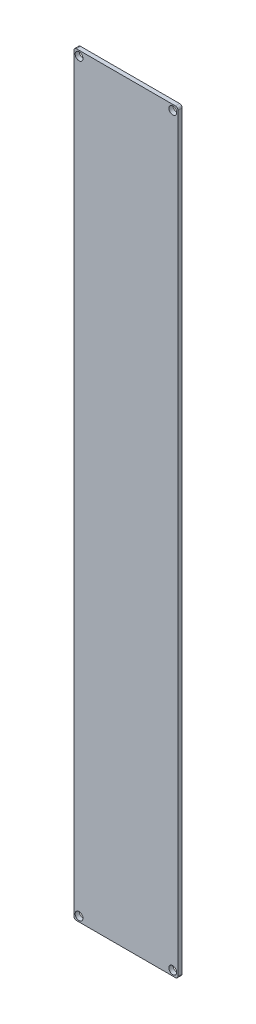
ISO-10303-21;
HEADER;
FILE_DESCRIPTION(('STEP AP214'),'2;1');
FILE_NAME('part.step','',(''),(''),'','','');
FILE_SCHEMA(('AUTOMOTIVE_DESIGN { 1 0 10303 214 1 1 1 1 }'));
ENDSEC;
DATA;
#1=APPLICATION_CONTEXT('core data for automotive mechanical design processes');
#2=APPLICATION_PROTOCOL_DEFINITION('international standard','automotive_design',2000,#1);
#3=PRODUCT_CONTEXT('',#1,'mechanical');
#4=PRODUCT('Part','Part','',(#3));
#5=PRODUCT_RELATED_PRODUCT_CATEGORY('part','',(#4));
#6=PRODUCT_DEFINITION_FORMATION('','',#4);
#7=PRODUCT_DEFINITION_CONTEXT('part definition',#1,'design');
#8=PRODUCT_DEFINITION('design','',#6,#7);
#9=PRODUCT_DEFINITION_SHAPE('','',#8);
#10=(LENGTH_UNIT() NAMED_UNIT(*) SI_UNIT(.MILLI.,.METRE.));
#11=(NAMED_UNIT(*) PLANE_ANGLE_UNIT() SI_UNIT($,.RADIAN.));
#12=(NAMED_UNIT(*) SI_UNIT($,.STERADIAN.) SOLID_ANGLE_UNIT());
#13=UNCERTAINTY_MEASURE_WITH_UNIT(LENGTH_MEASURE(1.E-05),#10,'distance_accuracy_value','');
#14=(GEOMETRIC_REPRESENTATION_CONTEXT(3) GLOBAL_UNCERTAINTY_ASSIGNED_CONTEXT((#13)) GLOBAL_UNIT_ASSIGNED_CONTEXT((#10,
#11,#12)) REPRESENTATION_CONTEXT('',''));
#15=CARTESIAN_POINT('',(0.,0.,0.));
#16=DIRECTION('',(0.,0.,1.));
#17=DIRECTION('',(1.,0.,0.));
#18=AXIS2_PLACEMENT_3D('',#15,#16,#17);
#19=CARTESIAN_POINT('',(-35.5384615384615,79.3692307692308,1.6));
#20=DIRECTION('',(1.,0.,0.));
#21=DIRECTION('',(0.,1.,0.));
#22=AXIS2_PLACEMENT_3D('',#19,#20,#21);
#23=PLANE('',#22);
#24=DIRECTION('',(0.,-1.,0.));
#25=VECTOR('',#24,1.);
#26=CARTESIAN_POINT('',(-35.5384615384615,79.3692307692308,1.6));
#27=LINE('',#26,#25);
#28=CARTESIAN_POINT('',(-35.5384615384615,78.3692307692308,1.6));
#29=VERTEX_POINT('',#28);
#30=CARTESIAN_POINT('',(-35.5384615384615,-209.630769230769,1.6));
#31=VERTEX_POINT('',#30);
#32=EDGE_CURVE('E119',#29,#31,#27,.T.);
#33=ORIENTED_EDGE('',*,*,#32,.F.);
#34=DIRECTION('',(0.,0.,-1.));
#35=VECTOR('',#34,1.);
#36=CARTESIAN_POINT('',(-35.5384615384615,78.3692307692308,1.6));
#37=LINE('',#36,#35);
#38=CARTESIAN_POINT('',(-35.5384615384615,78.3692307692308,0.));
#39=VERTEX_POINT('',#38);
#40=EDGE_CURVE('E104',#29,#39,#37,.T.);
#41=ORIENTED_EDGE('',*,*,#40,.T.);
#42=DIRECTION('',(0.,-1.,0.));
#43=VECTOR('',#42,1.);
#44=CARTESIAN_POINT('',(-35.5384615384615,79.3692307692308,0.));
#45=LINE('',#44,#43);
#46=CARTESIAN_POINT('',(-35.5384615384615,-209.630769230769,0.));
#47=VERTEX_POINT('',#46);
#48=EDGE_CURVE('E116',#39,#47,#45,.T.);
#49=ORIENTED_EDGE('',*,*,#48,.T.);
#50=DIRECTION('',(0.,0.,-1.));
#51=VECTOR('',#50,1.);
#52=CARTESIAN_POINT('',(-35.5384615384615,-209.630769230769,1.6));
#53=LINE('',#52,#51);
#54=EDGE_CURVE('E121',#47,#31,#53,.F.);
#55=ORIENTED_EDGE('',*,*,#54,.T.);
#56=EDGE_LOOP('',(#33,#41,#49,#55));
#57=FACE_BOUND('',#56,.T.);
#58=ADVANCED_FACE('F34',(#57),#23,.F.);
#59=CARTESIAN_POINT('',(-35.5384615384615,-210.630769230769,1.6));
#60=DIRECTION('',(0.,1.,0.));
#61=DIRECTION('',(0.,0.,1.));
#62=AXIS2_PLACEMENT_3D('',#59,#60,#61);
#63=PLANE('',#62);
#64=DIRECTION('',(1.,0.,0.));
#65=VECTOR('',#64,1.);
#66=CARTESIAN_POINT('',(-35.5384615384615,-210.630769230769,0.));
#67=LINE('',#66,#65);
#68=CARTESIAN_POINT('',(-34.5384615384615,-210.630769230769,0.));
#69=VERTEX_POINT('',#68);
#70=CARTESIAN_POINT('',(3.46153846153849,-210.630769230769,0.));
#71=VERTEX_POINT('',#70);
#72=EDGE_CURVE('E125',#69,#71,#67,.T.);
#73=ORIENTED_EDGE('',*,*,#72,.T.);
#74=DIRECTION('',(0.,0.,-1.));
#75=VECTOR('',#74,1.);
#76=CARTESIAN_POINT('',(3.46153846153849,-210.630769230769,1.6));
#77=LINE('',#76,#75);
#78=CARTESIAN_POINT('',(3.46153846153849,-210.630769230769,1.6));
#79=VERTEX_POINT('',#78);
#80=EDGE_CURVE('E11',#71,#79,#77,.F.);
#81=ORIENTED_EDGE('',*,*,#80,.T.);
#82=DIRECTION('',(1.,0.,0.));
#83=VECTOR('',#82,1.);
#84=CARTESIAN_POINT('',(-35.5384615384615,-210.630769230769,1.6));
#85=LINE('',#84,#83);
#86=CARTESIAN_POINT('',(-34.5384615384615,-210.630769230769,1.6));
#87=VERTEX_POINT('',#86);
#88=EDGE_CURVE('E165',#87,#79,#85,.T.);
#89=ORIENTED_EDGE('',*,*,#88,.F.);
#90=DIRECTION('',(0.,0.,-1.));
#91=VECTOR('',#90,1.);
#92=CARTESIAN_POINT('',(-34.5384615384615,-210.630769230769,1.6));
#93=LINE('',#92,#91);
#94=EDGE_CURVE('E42',#87,#69,#93,.T.);
#95=ORIENTED_EDGE('',*,*,#94,.T.);
#96=EDGE_LOOP('',(#73,#81,#89,#95));
#97=FACE_BOUND('',#96,.T.);
#98=ADVANCED_FACE('F163',(#97),#63,.F.);
#99=CARTESIAN_POINT('',(4.46153846153845,79.3692307692308,1.6));
#100=DIRECTION('',(-1.,0.,0.));
#101=DIRECTION('',(0.,-1.,0.));
#102=AXIS2_PLACEMENT_3D('',#99,#100,#101);
#103=PLANE('',#102);
#104=DIRECTION('',(0.,1.,0.));
#105=VECTOR('',#104,1.);
#106=CARTESIAN_POINT('',(4.46153846153845,79.3692307692308,0.));
#107=LINE('',#106,#105);
#108=CARTESIAN_POINT('',(4.46153846153849,-209.630769230769,0.));
#109=VERTEX_POINT('',#108);
#110=CARTESIAN_POINT('',(4.46153846153845,78.3692307692308,0.));
#111=VERTEX_POINT('',#110);
#112=EDGE_CURVE('E129',#109,#111,#107,.T.);
#113=ORIENTED_EDGE('',*,*,#112,.T.);
#114=DIRECTION('',(0.,0.,-1.));
#115=VECTOR('',#114,1.);
#116=CARTESIAN_POINT('',(4.46153846153845,78.3692307692308,1.6));
#117=LINE('',#116,#115);
#118=CARTESIAN_POINT('',(4.46153846153845,78.3692307692308,1.6));
#119=VERTEX_POINT('',#118);
#120=EDGE_CURVE('E49',#111,#119,#117,.F.);
#121=ORIENTED_EDGE('',*,*,#120,.T.);
#122=DIRECTION('',(0.,1.,0.));
#123=VECTOR('',#122,1.);
#124=CARTESIAN_POINT('',(4.46153846153845,79.3692307692308,1.6));
#125=LINE('',#124,#123);
#126=CARTESIAN_POINT('',(4.46153846153849,-209.630769230769,1.6));
#127=VERTEX_POINT('',#126);
#128=EDGE_CURVE('E173',#127,#119,#125,.T.);
#129=ORIENTED_EDGE('',*,*,#128,.F.);
#130=DIRECTION('',(0.,0.,-1.));
#131=VECTOR('',#130,1.);
#132=CARTESIAN_POINT('',(4.46153846153849,-209.630769230769,1.6));
#133=LINE('',#132,#131);
#134=EDGE_CURVE('E156',#127,#109,#133,.T.);
#135=ORIENTED_EDGE('',*,*,#134,.T.);
#136=EDGE_LOOP('',(#113,#121,#129,#135));
#137=FACE_BOUND('',#136,.T.);
#138=ADVANCED_FACE('F172',(#137),#103,.F.);
#139=CARTESIAN_POINT('',(-35.5384615384615,79.3692307692308,1.6));
#140=DIRECTION('',(0.,-1.,0.));
#141=DIRECTION('',(0.,0.,-1.));
#142=AXIS2_PLACEMENT_3D('',#139,#140,#141);
#143=PLANE('',#142);
#144=DIRECTION('',(-1.,0.,0.));
#145=VECTOR('',#144,1.);
#146=CARTESIAN_POINT('',(-35.5384615384615,79.3692307692308,0.));
#147=LINE('',#146,#145);
#148=CARTESIAN_POINT('',(3.46153846153845,79.3692307692308,0.));
#149=VERTEX_POINT('',#148);
#150=CARTESIAN_POINT('',(-34.5384615384615,79.3692307692308,0.));
#151=VERTEX_POINT('',#150);
#152=EDGE_CURVE('E139',#149,#151,#147,.T.);
#153=ORIENTED_EDGE('',*,*,#152,.T.);
#154=DIRECTION('',(0.,0.,-1.));
#155=VECTOR('',#154,1.);
#156=CARTESIAN_POINT('',(-34.5384615384615,79.3692307692308,1.6));
#157=LINE('',#156,#155);
#158=CARTESIAN_POINT('',(-34.5384615384615,79.3692307692308,1.6));
#159=VERTEX_POINT('',#158);
#160=EDGE_CURVE('E105',#151,#159,#157,.F.);
#161=ORIENTED_EDGE('',*,*,#160,.T.);
#162=DIRECTION('',(-1.,0.,0.));
#163=VECTOR('',#162,1.);
#164=CARTESIAN_POINT('',(-35.5384615384615,79.3692307692308,1.6));
#165=LINE('',#164,#163);
#166=CARTESIAN_POINT('',(3.46153846153845,79.3692307692308,1.6));
#167=VERTEX_POINT('',#166);
#168=EDGE_CURVE('E135',#167,#159,#165,.T.);
#169=ORIENTED_EDGE('',*,*,#168,.F.);
#170=DIRECTION('',(0.,0.,-1.));
#171=VECTOR('',#170,1.);
#172=CARTESIAN_POINT('',(3.46153846153845,79.3692307692308,1.6));
#173=LINE('',#172,#171);
#174=EDGE_CURVE('E110',#167,#149,#173,.T.);
#175=ORIENTED_EDGE('',*,*,#174,.T.);
#176=EDGE_LOOP('',(#153,#161,#169,#175));
#177=FACE_BOUND('',#176,.T.);
#178=ADVANCED_FACE('F213',(#177),#143,.F.);
#179=CARTESIAN_POINT('',(0.,0.,1.6));
#180=DIRECTION('',(0.,0.,1.));
#181=DIRECTION('',(1.,0.,0.));
#182=AXIS2_PLACEMENT_3D('',#179,#180,#181);
#183=PLANE('',#182);
#184=CARTESIAN_POINT('',(2.46153846153849,77.3692307692308,1.6));
#185=DIRECTION('',(0.,0.,1.));
#186=DIRECTION('',(1.,0.,0.));
#187=AXIS2_PLACEMENT_3D('',#184,#185,#186);
#188=CIRCLE('',#187,1.5);
#189=CARTESIAN_POINT('',(3.96153846153849,77.3692307692308,1.6));
#190=VERTEX_POINT('',#189);
#191=EDGE_CURVE('E189',#190,#190,#188,.T.);
#192=ORIENTED_EDGE('',*,*,#191,.F.);
#193=EDGE_LOOP('',(#192));
#194=FACE_BOUND('',#193,.T.);
#195=CARTESIAN_POINT('',(-33.5384615384615,-208.630769230769,1.6));
#196=DIRECTION('',(0.,0.,1.));
#197=DIRECTION('',(1.,0.,0.));
#198=AXIS2_PLACEMENT_3D('',#195,#196,#197);
#199=CIRCLE('',#198,1.5);
#200=CARTESIAN_POINT('',(-32.0384615384615,-208.630769230769,1.6));
#201=VERTEX_POINT('',#200);
#202=EDGE_CURVE('E182',#201,#201,#199,.T.);
#203=ORIENTED_EDGE('',*,*,#202,.F.);
#204=EDGE_LOOP('',(#203));
#205=FACE_BOUND('',#204,.T.);
#206=CARTESIAN_POINT('',(2.46153846153849,-208.630769230769,1.6));
#207=DIRECTION('',(0.,0.,1.));
#208=DIRECTION('',(1.,0.,0.));
#209=AXIS2_PLACEMENT_3D('',#206,#207,#208);
#210=CIRCLE('',#209,1.5);
#211=CARTESIAN_POINT('',(3.96153846153849,-208.630769230769,1.6));
#212=VERTEX_POINT('',#211);
#213=EDGE_CURVE('E194',#212,#212,#210,.T.);
#214=ORIENTED_EDGE('',*,*,#213,.F.);
#215=EDGE_LOOP('',(#214));
#216=FACE_BOUND('',#215,.T.);
#217=CARTESIAN_POINT('',(-33.5384615384615,77.3692307692308,1.6));
#218=DIRECTION('',(0.,0.,1.));
#219=DIRECTION('',(1.,0.,0.));
#220=AXIS2_PLACEMENT_3D('',#217,#218,#219);
#221=CIRCLE('',#220,1.5);
#222=CARTESIAN_POINT('',(-32.0384615384615,77.3692307692308,1.6));
#223=VERTEX_POINT('',#222);
#224=EDGE_CURVE('E132',#223,#223,#221,.T.);
#225=ORIENTED_EDGE('',*,*,#224,.F.);
#226=EDGE_LOOP('',(#225));
#227=FACE_BOUND('',#226,.T.);
#228=ORIENTED_EDGE('',*,*,#168,.T.);
#229=CARTESIAN_POINT('',(-34.5384615384615,78.3692307692308,1.6));
#230=DIRECTION('',(0.,0.,1.));
#231=DIRECTION('',(1.,0.,0.));
#232=AXIS2_PLACEMENT_3D('',#229,#230,#231);
#233=CIRCLE('',#232,1.);
#234=EDGE_CURVE('E154',#159,#29,#233,.T.);
#235=ORIENTED_EDGE('',*,*,#234,.T.);
#236=ORIENTED_EDGE('',*,*,#32,.T.);
#237=CARTESIAN_POINT('',(-34.5384615384615,-209.630769230769,1.6));
#238=DIRECTION('',(0.,0.,1.));
#239=DIRECTION('',(1.,0.,0.));
#240=AXIS2_PLACEMENT_3D('',#237,#238,#239);
#241=CIRCLE('',#240,1.);
#242=EDGE_CURVE('E149',#31,#87,#241,.T.);
#243=ORIENTED_EDGE('',*,*,#242,.T.);
#244=ORIENTED_EDGE('',*,*,#88,.T.);
#245=CARTESIAN_POINT('',(3.46153846153849,-209.630769230769,1.6));
#246=DIRECTION('',(0.,0.,1.));
#247=DIRECTION('',(1.,0.,0.));
#248=AXIS2_PLACEMENT_3D('',#245,#246,#247);
#249=CIRCLE('',#248,1.);
#250=EDGE_CURVE('E56',#79,#127,#249,.T.);
#251=ORIENTED_EDGE('',*,*,#250,.T.);
#252=ORIENTED_EDGE('',*,*,#128,.T.);
#253=CARTESIAN_POINT('',(3.46153846153845,78.3692307692308,1.6));
#254=DIRECTION('',(0.,0.,1.));
#255=DIRECTION('',(1.,0.,0.));
#256=AXIS2_PLACEMENT_3D('',#253,#254,#255);
#257=CIRCLE('',#256,1.);
#258=EDGE_CURVE('E152',#119,#167,#257,.T.);
#259=ORIENTED_EDGE('',*,*,#258,.T.);
#260=EDGE_LOOP('',(#228,#235,#236,#243,#244,#251,#252,#259));
#261=FACE_BOUND('',#260,.T.);
#262=ADVANCED_FACE('F210',(#194,#205,#216,#227,#261),#183,.T.);
#263=CARTESIAN_POINT('',(0.,0.,0.));
#264=DIRECTION('',(0.,0.,1.));
#265=DIRECTION('',(1.,0.,0.));
#266=AXIS2_PLACEMENT_3D('',#263,#264,#265);
#267=PLANE('',#266);
#268=CARTESIAN_POINT('',(2.46153846153849,77.3692307692308,0.));
#269=DIRECTION('',(0.,0.,1.));
#270=DIRECTION('',(1.,0.,0.));
#271=AXIS2_PLACEMENT_3D('',#268,#269,#270);
#272=CIRCLE('',#271,1.5);
#273=CARTESIAN_POINT('',(3.96153846153849,77.3692307692308,0.));
#274=VERTEX_POINT('',#273);
#275=EDGE_CURVE('E180',#274,#274,#272,.T.);
#276=ORIENTED_EDGE('',*,*,#275,.T.);
#277=EDGE_LOOP('',(#276));
#278=FACE_BOUND('',#277,.T.);
#279=CARTESIAN_POINT('',(-33.5384615384615,-208.630769230769,0.));
#280=DIRECTION('',(0.,0.,1.));
#281=DIRECTION('',(1.,0.,0.));
#282=AXIS2_PLACEMENT_3D('',#279,#280,#281);
#283=CIRCLE('',#282,1.5);
#284=CARTESIAN_POINT('',(-32.0384615384615,-208.630769230769,0.));
#285=VERTEX_POINT('',#284);
#286=EDGE_CURVE('E185',#285,#285,#283,.T.);
#287=ORIENTED_EDGE('',*,*,#286,.T.);
#288=EDGE_LOOP('',(#287));
#289=FACE_BOUND('',#288,.T.);
#290=CARTESIAN_POINT('',(2.46153846153849,-208.630769230769,0.));
#291=DIRECTION('',(0.,0.,1.));
#292=DIRECTION('',(1.,0.,0.));
#293=AXIS2_PLACEMENT_3D('',#290,#291,#292);
#294=CIRCLE('',#293,1.5);
#295=CARTESIAN_POINT('',(3.96153846153849,-208.630769230769,0.));
#296=VERTEX_POINT('',#295);
#297=EDGE_CURVE('E186',#296,#296,#294,.T.);
#298=ORIENTED_EDGE('',*,*,#297,.T.);
#299=EDGE_LOOP('',(#298));
#300=FACE_BOUND('',#299,.T.);
#301=CARTESIAN_POINT('',(-33.5384615384615,77.3692307692308,0.));
#302=DIRECTION('',(0.,0.,1.));
#303=DIRECTION('',(1.,0.,0.));
#304=AXIS2_PLACEMENT_3D('',#301,#302,#303);
#305=CIRCLE('',#304,1.5);
#306=CARTESIAN_POINT('',(-32.0384615384615,77.3692307692308,0.));
#307=VERTEX_POINT('',#306);
#308=EDGE_CURVE('E126',#307,#307,#305,.T.);
#309=ORIENTED_EDGE('',*,*,#308,.T.);
#310=EDGE_LOOP('',(#309));
#311=FACE_BOUND('',#310,.T.);
#312=ORIENTED_EDGE('',*,*,#48,.F.);
#313=CARTESIAN_POINT('',(-34.5384615384615,78.3692307692308,0.));
#314=DIRECTION('',(0.,0.,1.));
#315=DIRECTION('',(1.,0.,0.));
#316=AXIS2_PLACEMENT_3D('',#313,#314,#315);
#317=CIRCLE('',#316,1.);
#318=EDGE_CURVE('E100',#39,#151,#317,.F.);
#319=ORIENTED_EDGE('',*,*,#318,.T.);
#320=ORIENTED_EDGE('',*,*,#152,.F.);
#321=CARTESIAN_POINT('',(3.46153846153845,78.3692307692308,0.));
#322=DIRECTION('',(0.,0.,1.));
#323=DIRECTION('',(1.,0.,0.));
#324=AXIS2_PLACEMENT_3D('',#321,#322,#323);
#325=CIRCLE('',#324,1.);
#326=EDGE_CURVE('E111',#149,#111,#325,.F.);
#327=ORIENTED_EDGE('',*,*,#326,.T.);
#328=ORIENTED_EDGE('',*,*,#112,.F.);
#329=CARTESIAN_POINT('',(3.46153846153849,-209.630769230769,0.));
#330=DIRECTION('',(0.,0.,1.));
#331=DIRECTION('',(1.,0.,0.));
#332=AXIS2_PLACEMENT_3D('',#329,#330,#331);
#333=CIRCLE('',#332,1.);
#334=EDGE_CURVE('E143',#109,#71,#333,.F.);
#335=ORIENTED_EDGE('',*,*,#334,.T.);
#336=ORIENTED_EDGE('',*,*,#72,.F.);
#337=CARTESIAN_POINT('',(-34.5384615384615,-209.630769230769,0.));
#338=DIRECTION('',(0.,0.,1.));
#339=DIRECTION('',(1.,0.,0.));
#340=AXIS2_PLACEMENT_3D('',#337,#338,#339);
#341=CIRCLE('',#340,1.);
#342=EDGE_CURVE('E120',#69,#47,#341,.F.);
#343=ORIENTED_EDGE('',*,*,#342,.T.);
#344=EDGE_LOOP('',(#312,#319,#320,#327,#328,#335,#336,#343));
#345=FACE_BOUND('',#344,.T.);
#346=ADVANCED_FACE('F123',(#278,#289,#300,#311,#345),#267,.F.);
#347=CARTESIAN_POINT('',(-33.5384615384615,77.3692307692308,0.));
#348=DIRECTION('',(0.,0.,1.));
#349=DIRECTION('',(1.,0.,0.));
#350=AXIS2_PLACEMENT_3D('',#347,#348,#349);
#351=CYLINDRICAL_SURFACE('',#350,1.5);
#352=ORIENTED_EDGE('',*,*,#308,.F.);
#353=EDGE_LOOP('',(#352));
#354=FACE_BOUND('',#353,.T.);
#355=ORIENTED_EDGE('',*,*,#224,.T.);
#356=EDGE_LOOP('',(#355));
#357=FACE_BOUND('',#356,.T.);
#358=ADVANCED_FACE('F206',(#354,#357),#351,.F.);
#359=CARTESIAN_POINT('',(2.46153846153849,-208.630769230769,0.));
#360=DIRECTION('',(0.,0.,1.));
#361=DIRECTION('',(1.,0.,0.));
#362=AXIS2_PLACEMENT_3D('',#359,#360,#361);
#363=CYLINDRICAL_SURFACE('',#362,1.5);
#364=ORIENTED_EDGE('',*,*,#297,.F.);
#365=EDGE_LOOP('',(#364));
#366=FACE_BOUND('',#365,.T.);
#367=ORIENTED_EDGE('',*,*,#213,.T.);
#368=EDGE_LOOP('',(#367));
#369=FACE_BOUND('',#368,.T.);
#370=ADVANCED_FACE('F202',(#366,#369),#363,.F.);
#371=CARTESIAN_POINT('',(-33.5384615384615,-208.630769230769,0.));
#372=DIRECTION('',(0.,0.,1.));
#373=DIRECTION('',(1.,0.,0.));
#374=AXIS2_PLACEMENT_3D('',#371,#372,#373);
#375=CYLINDRICAL_SURFACE('',#374,1.5);
#376=ORIENTED_EDGE('',*,*,#286,.F.);
#377=EDGE_LOOP('',(#376));
#378=FACE_BOUND('',#377,.T.);
#379=ORIENTED_EDGE('',*,*,#202,.T.);
#380=EDGE_LOOP('',(#379));
#381=FACE_BOUND('',#380,.T.);
#382=ADVANCED_FACE('F205',(#378,#381),#375,.F.);
#383=CARTESIAN_POINT('',(2.46153846153849,77.3692307692308,0.));
#384=DIRECTION('',(0.,0.,1.));
#385=DIRECTION('',(1.,0.,0.));
#386=AXIS2_PLACEMENT_3D('',#383,#384,#385);
#387=CYLINDRICAL_SURFACE('',#386,1.5);
#388=ORIENTED_EDGE('',*,*,#275,.F.);
#389=EDGE_LOOP('',(#388));
#390=FACE_BOUND('',#389,.T.);
#391=ORIENTED_EDGE('',*,*,#191,.T.);
#392=EDGE_LOOP('',(#391));
#393=FACE_BOUND('',#392,.T.);
#394=ADVANCED_FACE('F228',(#390,#393),#387,.F.);
#395=CARTESIAN_POINT('',(-34.5384615384615,78.3692307692308,1.6));
#396=DIRECTION('',(0.,0.,-1.));
#397=DIRECTION('',(-1.,0.,0.));
#398=AXIS2_PLACEMENT_3D('',#395,#396,#397);
#399=CYLINDRICAL_SURFACE('',#398,1.);
#400=ORIENTED_EDGE('',*,*,#234,.F.);
#401=ORIENTED_EDGE('',*,*,#160,.F.);
#402=ORIENTED_EDGE('',*,*,#318,.F.);
#403=ORIENTED_EDGE('',*,*,#40,.F.);
#404=EDGE_LOOP('',(#400,#401,#402,#403));
#405=FACE_BOUND('',#404,.T.);
#406=ADVANCED_FACE('F103',(#405),#399,.T.);
#407=CARTESIAN_POINT('',(3.46153846153845,78.3692307692308,1.6));
#408=DIRECTION('',(0.,0.,-1.));
#409=DIRECTION('',(-1.,0.,0.));
#410=AXIS2_PLACEMENT_3D('',#407,#408,#409);
#411=CYLINDRICAL_SURFACE('',#410,1.);
#412=ORIENTED_EDGE('',*,*,#258,.F.);
#413=ORIENTED_EDGE('',*,*,#120,.F.);
#414=ORIENTED_EDGE('',*,*,#326,.F.);
#415=ORIENTED_EDGE('',*,*,#174,.F.);
#416=EDGE_LOOP('',(#412,#413,#414,#415));
#417=FACE_BOUND('',#416,.T.);
#418=ADVANCED_FACE('F221',(#417),#411,.T.);
#419=CARTESIAN_POINT('',(3.46153846153849,-209.630769230769,1.6));
#420=DIRECTION('',(0.,0.,-1.));
#421=DIRECTION('',(-1.,0.,0.));
#422=AXIS2_PLACEMENT_3D('',#419,#420,#421);
#423=CYLINDRICAL_SURFACE('',#422,1.);
#424=ORIENTED_EDGE('',*,*,#250,.F.);
#425=ORIENTED_EDGE('',*,*,#80,.F.);
#426=ORIENTED_EDGE('',*,*,#334,.F.);
#427=ORIENTED_EDGE('',*,*,#134,.F.);
#428=EDGE_LOOP('',(#424,#425,#426,#427));
#429=FACE_BOUND('',#428,.T.);
#430=ADVANCED_FACE('F171',(#429),#423,.T.);
#431=CARTESIAN_POINT('',(-34.5384615384615,-209.630769230769,1.6));
#432=DIRECTION('',(0.,0.,-1.));
#433=DIRECTION('',(-1.,0.,0.));
#434=AXIS2_PLACEMENT_3D('',#431,#432,#433);
#435=CYLINDRICAL_SURFACE('',#434,1.);
#436=ORIENTED_EDGE('',*,*,#242,.F.);
#437=ORIENTED_EDGE('',*,*,#54,.F.);
#438=ORIENTED_EDGE('',*,*,#342,.F.);
#439=ORIENTED_EDGE('',*,*,#94,.F.);
#440=EDGE_LOOP('',(#436,#437,#438,#439));
#441=FACE_BOUND('',#440,.T.);
#442=ADVANCED_FACE('F36',(#441),#435,.T.);
#443=CLOSED_SHELL('',(#58,#98,#138,#178,#262,#346,#358,#370,#382,#394,#406,#418,#430,#442));
#444=MANIFOLD_SOLID_BREP('B2',#443);
#445=ADVANCED_BREP_SHAPE_REPRESENTATION('',(#18,#444),#14);
#446=SHAPE_DEFINITION_REPRESENTATION(#9,#445);
ENDSEC;
END-ISO-10303-21;
